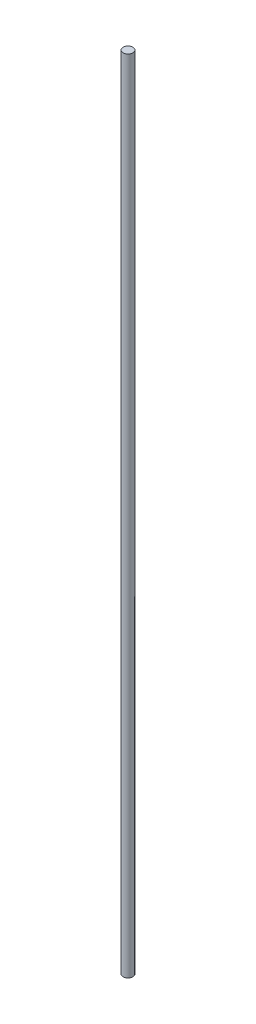
ISO-10303-21;
HEADER;
FILE_DESCRIPTION(('STEP AP214'),'2;1');
FILE_NAME('part.step','',(''),(''),'','','');
FILE_SCHEMA(('AUTOMOTIVE_DESIGN { 1 0 10303 214 1 1 1 1 }'));
ENDSEC;
DATA;
#1=APPLICATION_CONTEXT('core data for automotive mechanical design processes');
#2=APPLICATION_PROTOCOL_DEFINITION('international standard','automotive_design',2000,#1);
#3=PRODUCT_CONTEXT('',#1,'mechanical');
#4=PRODUCT('Part','Part','',(#3));
#5=PRODUCT_RELATED_PRODUCT_CATEGORY('part','',(#4));
#6=PRODUCT_DEFINITION_FORMATION('','',#4);
#7=PRODUCT_DEFINITION_CONTEXT('part definition',#1,'design');
#8=PRODUCT_DEFINITION('design','',#6,#7);
#9=PRODUCT_DEFINITION_SHAPE('','',#8);
#10=(LENGTH_UNIT() NAMED_UNIT(*) SI_UNIT(.MILLI.,.METRE.));
#11=(NAMED_UNIT(*) PLANE_ANGLE_UNIT() SI_UNIT($,.RADIAN.));
#12=(NAMED_UNIT(*) SI_UNIT($,.STERADIAN.) SOLID_ANGLE_UNIT());
#13=UNCERTAINTY_MEASURE_WITH_UNIT(LENGTH_MEASURE(1.E-05),#10,'distance_accuracy_value','');
#14=(GEOMETRIC_REPRESENTATION_CONTEXT(3) GLOBAL_UNCERTAINTY_ASSIGNED_CONTEXT((#13)) GLOBAL_UNIT_ASSIGNED_CONTEXT((#10,
#11,#12)) REPRESENTATION_CONTEXT('',''));
#15=CARTESIAN_POINT('',(0.,0.,0.));
#16=DIRECTION('',(0.,0.,1.));
#17=DIRECTION('',(1.,0.,0.));
#18=AXIS2_PLACEMENT_3D('',#15,#16,#17);
#19=CARTESIAN_POINT('',(0.,1040.,0.));
#20=DIRECTION('',(0.,-1.,0.));
#21=DIRECTION('',(0.,0.,-1.));
#22=AXIS2_PLACEMENT_3D('',#19,#20,#21);
#23=CYLINDRICAL_SURFACE('',#22,6.35);
#24=CARTESIAN_POINT('',(0.,1040.,0.));
#25=DIRECTION('',(0.,1.,0.));
#26=DIRECTION('',(0.,0.,1.));
#27=AXIS2_PLACEMENT_3D('',#24,#25,#26);
#28=CIRCLE('',#27,6.35);
#29=CARTESIAN_POINT('',(0.,1040.,6.35));
#30=VERTEX_POINT('',#29);
#31=EDGE_CURVE('E10',#30,#30,#28,.T.);
#32=ORIENTED_EDGE('',*,*,#31,.F.);
#33=EDGE_LOOP('',(#32));
#34=FACE_BOUND('',#33,.T.);
#35=CARTESIAN_POINT('',(0.,0.,0.));
#36=DIRECTION('',(0.,1.,0.));
#37=DIRECTION('',(0.,0.,1.));
#38=AXIS2_PLACEMENT_3D('',#35,#36,#37);
#39=CIRCLE('',#38,6.35);
#40=CARTESIAN_POINT('',(0.,0.,6.35));
#41=VERTEX_POINT('',#40);
#42=EDGE_CURVE('E34',#41,#41,#39,.T.);
#43=ORIENTED_EDGE('',*,*,#42,.T.);
#44=EDGE_LOOP('',(#43));
#45=FACE_BOUND('',#44,.T.);
#46=ADVANCED_FACE('F31',(#34,#45),#23,.T.);
#47=CARTESIAN_POINT('',(0.,1040.,0.));
#48=DIRECTION('',(0.,1.,0.));
#49=DIRECTION('',(0.,0.,1.));
#50=AXIS2_PLACEMENT_3D('',#47,#48,#49);
#51=PLANE('',#50);
#52=ORIENTED_EDGE('',*,*,#31,.T.);
#53=EDGE_LOOP('',(#52));
#54=FACE_BOUND('',#53,.T.);
#55=ADVANCED_FACE('F46',(#54),#51,.T.);
#56=CARTESIAN_POINT('',(0.,0.,0.));
#57=DIRECTION('',(0.,1.,0.));
#58=DIRECTION('',(0.,0.,1.));
#59=AXIS2_PLACEMENT_3D('',#56,#57,#58);
#60=PLANE('',#59);
#61=ORIENTED_EDGE('',*,*,#42,.F.);
#62=EDGE_LOOP('',(#61));
#63=FACE_BOUND('',#62,.T.);
#64=ADVANCED_FACE('F44',(#63),#60,.F.);
#65=CLOSED_SHELL('',(#46,#55,#64));
#66=MANIFOLD_SOLID_BREP('B2',#65);
#67=ADVANCED_BREP_SHAPE_REPRESENTATION('',(#18,#66),#14);
#68=SHAPE_DEFINITION_REPRESENTATION(#9,#67);
ENDSEC;
END-ISO-10303-21;
